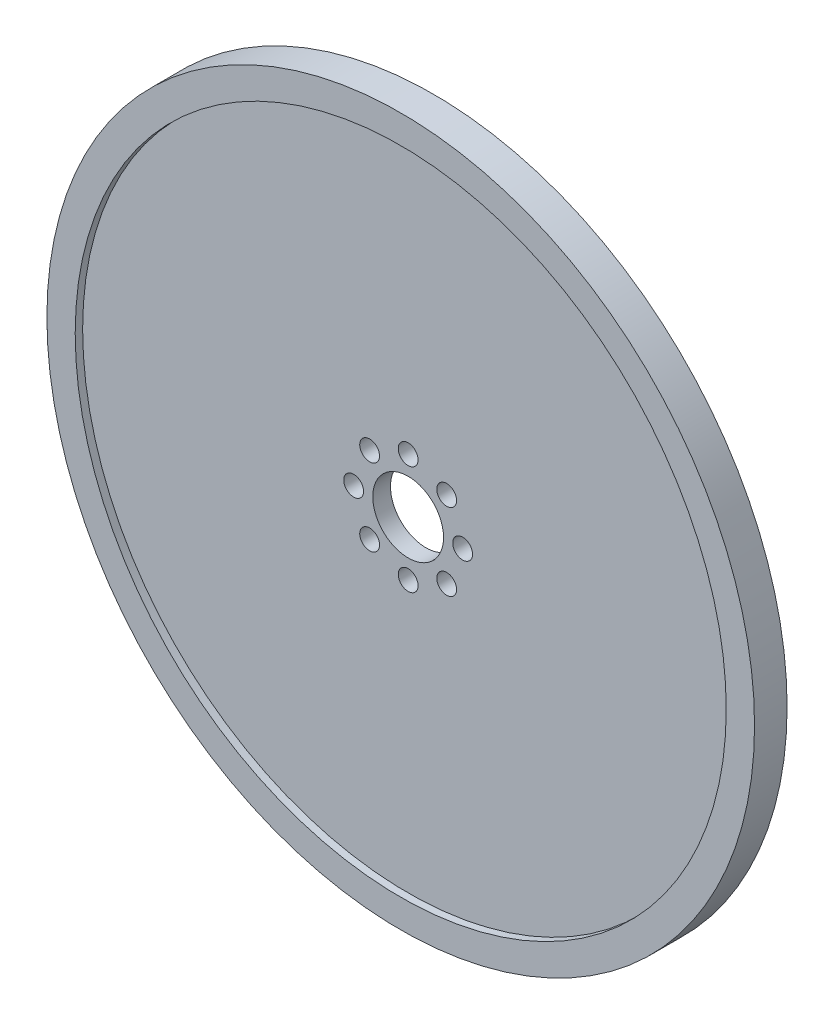
ISO-10303-21;
HEADER;
FILE_DESCRIPTION(('STEP AP214'),'2;1');
FILE_NAME('part.step','',(''),(''),'','','');
FILE_SCHEMA(('AUTOMOTIVE_DESIGN { 1 0 10303 214 1 1 1 1 }'));
ENDSEC;
DATA;
#1=APPLICATION_CONTEXT('core data for automotive mechanical design processes');
#2=APPLICATION_PROTOCOL_DEFINITION('international standard','automotive_design',2000,#1);
#3=PRODUCT_CONTEXT('',#1,'mechanical');
#4=PRODUCT('Part','Part','',(#3));
#5=PRODUCT_RELATED_PRODUCT_CATEGORY('part','',(#4));
#6=PRODUCT_DEFINITION_FORMATION('','',#4);
#7=PRODUCT_DEFINITION_CONTEXT('part definition',#1,'design');
#8=PRODUCT_DEFINITION('design','',#6,#7);
#9=PRODUCT_DEFINITION_SHAPE('','',#8);
#10=(LENGTH_UNIT() NAMED_UNIT(*) SI_UNIT(.MILLI.,.METRE.));
#11=(NAMED_UNIT(*) PLANE_ANGLE_UNIT() SI_UNIT($,.RADIAN.));
#12=(NAMED_UNIT(*) SI_UNIT($,.STERADIAN.) SOLID_ANGLE_UNIT());
#13=UNCERTAINTY_MEASURE_WITH_UNIT(LENGTH_MEASURE(1.E-05),#10,'distance_accuracy_value','');
#14=(GEOMETRIC_REPRESENTATION_CONTEXT(3) GLOBAL_UNCERTAINTY_ASSIGNED_CONTEXT((#13)) GLOBAL_UNIT_ASSIGNED_CONTEXT((#10,
#11,#12)) REPRESENTATION_CONTEXT('',''));
#15=CARTESIAN_POINT('',(0.,0.,0.));
#16=DIRECTION('',(0.,0.,1.));
#17=DIRECTION('',(1.,0.,0.));
#18=AXIS2_PLACEMENT_3D('',#15,#16,#17);
#19=CARTESIAN_POINT('',(0.,0.,2.921));
#20=DIRECTION('',(0.,0.,-1.));
#21=DIRECTION('',(-1.,0.,0.));
#22=AXIS2_PLACEMENT_3D('',#19,#20,#21);
#23=CYLINDRICAL_SURFACE('',#22,58.42);
#24=CARTESIAN_POINT('',(0.,0.,-2.921));
#25=DIRECTION('',(0.,0.,1.));
#26=DIRECTION('',(1.,0.,0.));
#27=AXIS2_PLACEMENT_3D('',#24,#25,#26);
#28=CIRCLE('',#27,58.42);
#29=CARTESIAN_POINT('',(58.42,0.,-2.921));
#30=VERTEX_POINT('',#29);
#31=EDGE_CURVE('E48',#30,#30,#28,.T.);
#32=ORIENTED_EDGE('',*,*,#31,.F.);
#33=EDGE_LOOP('',(#32));
#34=FACE_BOUND('',#33,.T.);
#35=CARTESIAN_POINT('',(0.,0.,-1.5875));
#36=DIRECTION('',(0.,0.,1.));
#37=DIRECTION('',(1.,0.,0.));
#38=AXIS2_PLACEMENT_3D('',#35,#36,#37);
#39=CIRCLE('',#38,58.42);
#40=CARTESIAN_POINT('',(58.42,0.,-1.5875));
#41=VERTEX_POINT('',#40);
#42=EDGE_CURVE('E51',#41,#41,#39,.T.);
#43=ORIENTED_EDGE('',*,*,#42,.T.);
#44=EDGE_LOOP('',(#43));
#45=FACE_BOUND('',#44,.T.);
#46=ADVANCED_FACE('F30',(#34,#45),#23,.F.);
#47=CARTESIAN_POINT('',(0.,0.,2.921));
#48=DIRECTION('',(0.,0.,1.));
#49=DIRECTION('',(1.,0.,0.));
#50=AXIS2_PLACEMENT_3D('',#47,#48,#49);
#51=PLANE('',#50);
#52=CARTESIAN_POINT('',(0.,0.,2.921));
#53=DIRECTION('',(0.,0.,1.));
#54=DIRECTION('',(1.,0.,0.));
#55=AXIS2_PLACEMENT_3D('',#52,#53,#54);
#56=CIRCLE('',#55,63.5);
#57=CARTESIAN_POINT('',(63.5,0.,2.921));
#58=VERTEX_POINT('',#57);
#59=EDGE_CURVE('E37',#58,#58,#56,.T.);
#60=ORIENTED_EDGE('',*,*,#59,.T.);
#61=EDGE_LOOP('',(#60));
#62=FACE_BOUND('',#61,.T.);
#63=CARTESIAN_POINT('',(0.,0.,2.921));
#64=DIRECTION('',(0.,0.,1.));
#65=DIRECTION('',(1.,0.,0.));
#66=AXIS2_PLACEMENT_3D('',#63,#64,#65);
#67=CIRCLE('',#66,58.42);
#68=CARTESIAN_POINT('',(58.42,0.,2.921));
#69=VERTEX_POINT('',#68);
#70=EDGE_CURVE('E46',#69,#69,#67,.T.);
#71=ORIENTED_EDGE('',*,*,#70,.F.);
#72=EDGE_LOOP('',(#71));
#73=FACE_BOUND('',#72,.T.);
#74=ADVANCED_FACE('F133',(#62,#73),#51,.T.);
#75=CARTESIAN_POINT('',(0.,0.,-2.921));
#76=DIRECTION('',(0.,0.,1.));
#77=DIRECTION('',(1.,0.,0.));
#78=AXIS2_PLACEMENT_3D('',#75,#76,#77);
#79=PLANE('',#78);
#80=CARTESIAN_POINT('',(0.,0.,-2.921));
#81=DIRECTION('',(0.,0.,1.));
#82=DIRECTION('',(1.,0.,0.));
#83=AXIS2_PLACEMENT_3D('',#80,#81,#82);
#84=CIRCLE('',#83,63.5);
#85=CARTESIAN_POINT('',(63.5,0.,-2.921));
#86=VERTEX_POINT('',#85);
#87=EDGE_CURVE('E41',#86,#86,#84,.T.);
#88=ORIENTED_EDGE('',*,*,#87,.F.);
#89=EDGE_LOOP('',(#88));
#90=FACE_BOUND('',#89,.T.);
#91=ORIENTED_EDGE('',*,*,#31,.T.);
#92=EDGE_LOOP('',(#91));
#93=FACE_BOUND('',#92,.T.);
#94=ADVANCED_FACE('F138',(#90,#93),#79,.F.);
#95=CARTESIAN_POINT('',(0.,0.,2.921));
#96=DIRECTION('',(0.,0.,-1.));
#97=DIRECTION('',(-1.,0.,0.));
#98=AXIS2_PLACEMENT_3D('',#95,#96,#97);
#99=CYLINDRICAL_SURFACE('',#98,63.5);
#100=ORIENTED_EDGE('',*,*,#59,.F.);
#101=EDGE_LOOP('',(#100));
#102=FACE_BOUND('',#101,.T.);
#103=ORIENTED_EDGE('',*,*,#87,.T.);
#104=EDGE_LOOP('',(#103));
#105=FACE_BOUND('',#104,.T.);
#106=ADVANCED_FACE('F32',(#102,#105),#99,.T.);
#107=CARTESIAN_POINT('',(0.,0.,1.5875));
#108=DIRECTION('',(0.,0.,1.));
#109=DIRECTION('',(1.,0.,0.));
#110=AXIS2_PLACEMENT_3D('',#107,#108,#109);
#111=CIRCLE('',#110,58.42);
#112=CARTESIAN_POINT('',(58.42,0.,1.5875));
#113=VERTEX_POINT('',#112);
#114=EDGE_CURVE('E10',#113,#113,#111,.T.);
#115=ORIENTED_EDGE('',*,*,#114,.F.);
#116=EDGE_LOOP('',(#115));
#117=FACE_BOUND('',#116,.T.);
#118=ORIENTED_EDGE('',*,*,#70,.T.);
#119=EDGE_LOOP('',(#118));
#120=FACE_BOUND('',#119,.T.);
#121=ADVANCED_FACE('F117',(#117,#120),#23,.F.);
#122=CARTESIAN_POINT('',(0.,0.,1.5875));
#123=DIRECTION('',(0.,0.,1.));
#124=DIRECTION('',(1.,0.,0.));
#125=AXIS2_PLACEMENT_3D('',#122,#123,#124);
#126=PLANE('',#125);
#127=CARTESIAN_POINT('',(-9.779,1.02429588037641E-13,1.5875));
#128=DIRECTION('',(0.,0.,1.));
#129=DIRECTION('',(1.,0.,0.));
#130=AXIS2_PLACEMENT_3D('',#127,#128,#129);
#131=CIRCLE('',#130,1.778);
#132=CARTESIAN_POINT('',(-8.001,1.02429588037641E-13,1.5875));
#133=VERTEX_POINT('',#132);
#134=EDGE_CURVE('E96',#133,#133,#131,.T.);
#135=ORIENTED_EDGE('',*,*,#134,.F.);
#136=EDGE_LOOP('',(#135));
#137=FACE_BOUND('',#136,.T.);
#138=CARTESIAN_POINT('',(0.,-9.779,1.5875));
#139=DIRECTION('',(0.,0.,1.));
#140=DIRECTION('',(1.,0.,0.));
#141=AXIS2_PLACEMENT_3D('',#138,#139,#140);
#142=CIRCLE('',#141,1.778);
#143=CARTESIAN_POINT('',(1.77799999999993,-9.779,1.5875));
#144=VERTEX_POINT('',#143);
#145=EDGE_CURVE('E84',#144,#144,#142,.T.);
#146=ORIENTED_EDGE('',*,*,#145,.F.);
#147=EDGE_LOOP('',(#146));
#148=FACE_BOUND('',#147,.T.);
#149=CARTESIAN_POINT('',(9.779,0.,1.5875));
#150=DIRECTION('',(0.,0.,1.));
#151=DIRECTION('',(1.,0.,0.));
#152=AXIS2_PLACEMENT_3D('',#149,#150,#151);
#153=CIRCLE('',#152,1.778);
#154=CARTESIAN_POINT('',(11.557,0.,1.5875));
#155=VERTEX_POINT('',#154);
#156=EDGE_CURVE('E72',#155,#155,#153,.T.);
#157=ORIENTED_EDGE('',*,*,#156,.F.);
#158=EDGE_LOOP('',(#157));
#159=FACE_BOUND('',#158,.T.);
#160=CARTESIAN_POINT('',(0.,9.779,1.5875));
#161=DIRECTION('',(0.,0.,1.));
#162=DIRECTION('',(1.,0.,0.));
#163=AXIS2_PLACEMENT_3D('',#160,#161,#162);
#164=CIRCLE('',#163,1.778);
#165=CARTESIAN_POINT('',(1.778,9.779,1.5875));
#166=VERTEX_POINT('',#165);
#167=EDGE_CURVE('E60',#166,#166,#164,.T.);
#168=ORIENTED_EDGE('',*,*,#167,.F.);
#169=EDGE_LOOP('',(#168));
#170=FACE_BOUND('',#169,.T.);
#171=ORIENTED_EDGE('',*,*,#114,.T.);
#172=EDGE_LOOP('',(#171));
#173=FACE_BOUND('',#172,.T.);
#174=CARTESIAN_POINT('',(0.,0.,1.5875));
#175=DIRECTION('',(0.,0.,1.));
#176=DIRECTION('',(1.,0.,0.));
#177=AXIS2_PLACEMENT_3D('',#174,#175,#176);
#178=CIRCLE('',#177,6.35);
#179=CARTESIAN_POINT('',(6.35,0.,1.5875));
#180=VERTEX_POINT('',#179);
#181=EDGE_CURVE('E56',#180,#180,#178,.T.);
#182=ORIENTED_EDGE('',*,*,#181,.F.);
#183=EDGE_LOOP('',(#182));
#184=FACE_BOUND('',#183,.T.);
#185=CARTESIAN_POINT('',(6.91479721322326,6.91479721322324,1.5875));
#186=DIRECTION('',(0.,0.,1.));
#187=DIRECTION('',(1.,0.,0.));
#188=AXIS2_PLACEMENT_3D('',#185,#186,#187);
#189=CIRCLE('',#188,1.778);
#190=CARTESIAN_POINT('',(8.69279721322326,6.91479721322324,1.5875));
#191=VERTEX_POINT('',#190);
#192=EDGE_CURVE('E66',#191,#191,#189,.T.);
#193=ORIENTED_EDGE('',*,*,#192,.F.);
#194=EDGE_LOOP('',(#193));
#195=FACE_BOUND('',#194,.T.);
#196=CARTESIAN_POINT('',(6.91479721322321,-6.91479721322328,1.5875));
#197=DIRECTION('',(0.,0.,1.));
#198=DIRECTION('',(1.,0.,0.));
#199=AXIS2_PLACEMENT_3D('',#196,#197,#198);
#200=CIRCLE('',#199,1.778);
#201=CARTESIAN_POINT('',(8.69279721322321,-6.91479721322328,1.5875));
#202=VERTEX_POINT('',#201);
#203=EDGE_CURVE('E78',#202,#202,#200,.T.);
#204=ORIENTED_EDGE('',*,*,#203,.F.);
#205=EDGE_LOOP('',(#204));
#206=FACE_BOUND('',#205,.T.);
#207=CARTESIAN_POINT('',(-6.91479721322331,-6.91479721322319,1.5875));
#208=DIRECTION('',(0.,0.,1.));
#209=DIRECTION('',(1.,0.,0.));
#210=AXIS2_PLACEMENT_3D('',#207,#208,#209);
#211=CIRCLE('',#210,1.778);
#212=CARTESIAN_POINT('',(-5.13679721322331,-6.91479721322319,1.5875));
#213=VERTEX_POINT('',#212);
#214=EDGE_CURVE('E90',#213,#213,#211,.T.);
#215=ORIENTED_EDGE('',*,*,#214,.F.);
#216=EDGE_LOOP('',(#215));
#217=FACE_BOUND('',#216,.T.);
#218=CARTESIAN_POINT('',(-6.91479721322316,6.91479721322333,1.5875));
#219=DIRECTION('',(0.,0.,1.));
#220=DIRECTION('',(1.,0.,0.));
#221=AXIS2_PLACEMENT_3D('',#218,#219,#220);
#222=CIRCLE('',#221,1.778);
#223=CARTESIAN_POINT('',(-5.13679721322316,6.91479721322333,1.5875));
#224=VERTEX_POINT('',#223);
#225=EDGE_CURVE('E102',#224,#224,#222,.T.);
#226=ORIENTED_EDGE('',*,*,#225,.F.);
#227=EDGE_LOOP('',(#226));
#228=FACE_BOUND('',#227,.T.);
#229=ADVANCED_FACE('F114',(#137,#148,#159,#170,#173,#184,#195,#206,#217,#228),#126,.T.);
#230=CARTESIAN_POINT('',(0.,0.,-1.5875));
#231=DIRECTION('',(0.,0.,1.));
#232=DIRECTION('',(1.,0.,0.));
#233=AXIS2_PLACEMENT_3D('',#230,#231,#232);
#234=PLANE('',#233);
#235=CARTESIAN_POINT('',(-9.779,1.02429588037641E-13,-1.5875));
#236=DIRECTION('',(0.,0.,1.));
#237=DIRECTION('',(1.,0.,0.));
#238=AXIS2_PLACEMENT_3D('',#235,#236,#237);
#239=CIRCLE('',#238,1.778);
#240=CARTESIAN_POINT('',(-8.001,1.02429588037641E-13,-1.5875));
#241=VERTEX_POINT('',#240);
#242=EDGE_CURVE('E99',#241,#241,#239,.T.);
#243=ORIENTED_EDGE('',*,*,#242,.T.);
#244=EDGE_LOOP('',(#243));
#245=FACE_BOUND('',#244,.T.);
#246=CARTESIAN_POINT('',(0.,-9.779,-1.5875));
#247=DIRECTION('',(0.,0.,1.));
#248=DIRECTION('',(1.,0.,0.));
#249=AXIS2_PLACEMENT_3D('',#246,#247,#248);
#250=CIRCLE('',#249,1.778);
#251=CARTESIAN_POINT('',(1.77799999999993,-9.779,-1.5875));
#252=VERTEX_POINT('',#251);
#253=EDGE_CURVE('E87',#252,#252,#250,.T.);
#254=ORIENTED_EDGE('',*,*,#253,.T.);
#255=EDGE_LOOP('',(#254));
#256=FACE_BOUND('',#255,.T.);
#257=CARTESIAN_POINT('',(9.779,0.,-1.5875));
#258=DIRECTION('',(0.,0.,1.));
#259=DIRECTION('',(1.,0.,0.));
#260=AXIS2_PLACEMENT_3D('',#257,#258,#259);
#261=CIRCLE('',#260,1.778);
#262=CARTESIAN_POINT('',(11.557,0.,-1.5875));
#263=VERTEX_POINT('',#262);
#264=EDGE_CURVE('E75',#263,#263,#261,.T.);
#265=ORIENTED_EDGE('',*,*,#264,.T.);
#266=EDGE_LOOP('',(#265));
#267=FACE_BOUND('',#266,.T.);
#268=CARTESIAN_POINT('',(0.,9.779,-1.5875));
#269=DIRECTION('',(0.,0.,1.));
#270=DIRECTION('',(1.,0.,0.));
#271=AXIS2_PLACEMENT_3D('',#268,#269,#270);
#272=CIRCLE('',#271,1.778);
#273=CARTESIAN_POINT('',(1.778,9.779,-1.5875));
#274=VERTEX_POINT('',#273);
#275=EDGE_CURVE('E63',#274,#274,#272,.T.);
#276=ORIENTED_EDGE('',*,*,#275,.T.);
#277=EDGE_LOOP('',(#276));
#278=FACE_BOUND('',#277,.T.);
#279=ORIENTED_EDGE('',*,*,#42,.F.);
#280=EDGE_LOOP('',(#279));
#281=FACE_BOUND('',#280,.T.);
#282=CARTESIAN_POINT('',(0.,0.,-1.5875));
#283=DIRECTION('',(0.,0.,1.));
#284=DIRECTION('',(1.,0.,0.));
#285=AXIS2_PLACEMENT_3D('',#282,#283,#284);
#286=CIRCLE('',#285,6.35);
#287=CARTESIAN_POINT('',(6.35,0.,-1.5875));
#288=VERTEX_POINT('',#287);
#289=EDGE_CURVE('E57',#288,#288,#286,.T.);
#290=ORIENTED_EDGE('',*,*,#289,.T.);
#291=EDGE_LOOP('',(#290));
#292=FACE_BOUND('',#291,.T.);
#293=CARTESIAN_POINT('',(6.91479721322326,6.91479721322324,-1.5875));
#294=DIRECTION('',(0.,0.,1.));
#295=DIRECTION('',(1.,0.,0.));
#296=AXIS2_PLACEMENT_3D('',#293,#294,#295);
#297=CIRCLE('',#296,1.778);
#298=CARTESIAN_POINT('',(8.69279721322326,6.91479721322324,-1.5875));
#299=VERTEX_POINT('',#298);
#300=EDGE_CURVE('E69',#299,#299,#297,.T.);
#301=ORIENTED_EDGE('',*,*,#300,.T.);
#302=EDGE_LOOP('',(#301));
#303=FACE_BOUND('',#302,.T.);
#304=CARTESIAN_POINT('',(6.91479721322321,-6.91479721322328,-1.5875));
#305=DIRECTION('',(0.,0.,1.));
#306=DIRECTION('',(1.,0.,0.));
#307=AXIS2_PLACEMENT_3D('',#304,#305,#306);
#308=CIRCLE('',#307,1.778);
#309=CARTESIAN_POINT('',(8.69279721322321,-6.91479721322328,-1.5875));
#310=VERTEX_POINT('',#309);
#311=EDGE_CURVE('E81',#310,#310,#308,.T.);
#312=ORIENTED_EDGE('',*,*,#311,.T.);
#313=EDGE_LOOP('',(#312));
#314=FACE_BOUND('',#313,.T.);
#315=CARTESIAN_POINT('',(-6.91479721322331,-6.91479721322319,-1.5875));
#316=DIRECTION('',(0.,0.,1.));
#317=DIRECTION('',(1.,0.,0.));
#318=AXIS2_PLACEMENT_3D('',#315,#316,#317);
#319=CIRCLE('',#318,1.778);
#320=CARTESIAN_POINT('',(-5.13679721322331,-6.91479721322319,-1.5875));
#321=VERTEX_POINT('',#320);
#322=EDGE_CURVE('E93',#321,#321,#319,.T.);
#323=ORIENTED_EDGE('',*,*,#322,.T.);
#324=EDGE_LOOP('',(#323));
#325=FACE_BOUND('',#324,.T.);
#326=CARTESIAN_POINT('',(-6.91479721322316,6.91479721322333,-1.5875));
#327=DIRECTION('',(0.,0.,1.));
#328=DIRECTION('',(1.,0.,0.));
#329=AXIS2_PLACEMENT_3D('',#326,#327,#328);
#330=CIRCLE('',#329,1.778);
#331=CARTESIAN_POINT('',(-5.13679721322316,6.91479721322333,-1.5875));
#332=VERTEX_POINT('',#331);
#333=EDGE_CURVE('E105',#332,#332,#330,.T.);
#334=ORIENTED_EDGE('',*,*,#333,.T.);
#335=EDGE_LOOP('',(#334));
#336=FACE_BOUND('',#335,.T.);
#337=ADVANCED_FACE('F116',(#245,#256,#267,#278,#281,#292,#303,#314,#325,#336),#234,.F.);
#338=CARTESIAN_POINT('',(0.,0.,1.5875));
#339=DIRECTION('',(0.,0.,-1.));
#340=DIRECTION('',(-1.,0.,0.));
#341=AXIS2_PLACEMENT_3D('',#338,#339,#340);
#342=CYLINDRICAL_SURFACE('',#341,6.35);
#343=ORIENTED_EDGE('',*,*,#181,.T.);
#344=EDGE_LOOP('',(#343));
#345=FACE_BOUND('',#344,.T.);
#346=ORIENTED_EDGE('',*,*,#289,.F.);
#347=EDGE_LOOP('',(#346));
#348=FACE_BOUND('',#347,.T.);
#349=ADVANCED_FACE('F124',(#345,#348),#342,.F.);
#350=CARTESIAN_POINT('',(0.,9.779,1.5875));
#351=DIRECTION('',(0.,0.,-1.));
#352=DIRECTION('',(-1.,0.,0.));
#353=AXIS2_PLACEMENT_3D('',#350,#351,#352);
#354=CYLINDRICAL_SURFACE('',#353,1.778);
#355=ORIENTED_EDGE('',*,*,#167,.T.);
#356=EDGE_LOOP('',(#355));
#357=FACE_BOUND('',#356,.T.);
#358=ORIENTED_EDGE('',*,*,#275,.F.);
#359=EDGE_LOOP('',(#358));
#360=FACE_BOUND('',#359,.T.);
#361=ADVANCED_FACE('F178',(#357,#360),#354,.F.);
#362=CARTESIAN_POINT('',(6.91479721322326,6.91479721322324,1.5875));
#363=DIRECTION('',(0.,0.,-1.));
#364=DIRECTION('',(-1.,0.,0.));
#365=AXIS2_PLACEMENT_3D('',#362,#363,#364);
#366=CYLINDRICAL_SURFACE('',#365,1.778);
#367=ORIENTED_EDGE('',*,*,#192,.T.);
#368=EDGE_LOOP('',(#367));
#369=FACE_BOUND('',#368,.T.);
#370=ORIENTED_EDGE('',*,*,#300,.F.);
#371=EDGE_LOOP('',(#370));
#372=FACE_BOUND('',#371,.T.);
#373=ADVANCED_FACE('F187',(#369,#372),#366,.F.);
#374=CARTESIAN_POINT('',(9.779,0.,1.5875));
#375=DIRECTION('',(0.,0.,-1.));
#376=DIRECTION('',(-1.,0.,0.));
#377=AXIS2_PLACEMENT_3D('',#374,#375,#376);
#378=CYLINDRICAL_SURFACE('',#377,1.778);
#379=ORIENTED_EDGE('',*,*,#156,.T.);
#380=EDGE_LOOP('',(#379));
#381=FACE_BOUND('',#380,.T.);
#382=ORIENTED_EDGE('',*,*,#264,.F.);
#383=EDGE_LOOP('',(#382));
#384=FACE_BOUND('',#383,.T.);
#385=ADVANCED_FACE('F197',(#381,#384),#378,.F.);
#386=CARTESIAN_POINT('',(6.91479721322321,-6.91479721322328,1.5875));
#387=DIRECTION('',(0.,0.,-1.));
#388=DIRECTION('',(-1.,0.,0.));
#389=AXIS2_PLACEMENT_3D('',#386,#387,#388);
#390=CYLINDRICAL_SURFACE('',#389,1.778);
#391=ORIENTED_EDGE('',*,*,#203,.T.);
#392=EDGE_LOOP('',(#391));
#393=FACE_BOUND('',#392,.T.);
#394=ORIENTED_EDGE('',*,*,#311,.F.);
#395=EDGE_LOOP('',(#394));
#396=FACE_BOUND('',#395,.T.);
#397=ADVANCED_FACE('F207',(#393,#396),#390,.F.);
#398=CARTESIAN_POINT('',(0.,-9.779,1.5875));
#399=DIRECTION('',(0.,0.,-1.));
#400=DIRECTION('',(-1.,0.,0.));
#401=AXIS2_PLACEMENT_3D('',#398,#399,#400);
#402=CYLINDRICAL_SURFACE('',#401,1.778);
#403=ORIENTED_EDGE('',*,*,#145,.T.);
#404=EDGE_LOOP('',(#403));
#405=FACE_BOUND('',#404,.T.);
#406=ORIENTED_EDGE('',*,*,#253,.F.);
#407=EDGE_LOOP('',(#406));
#408=FACE_BOUND('',#407,.T.);
#409=ADVANCED_FACE('F217',(#405,#408),#402,.F.);
#410=CARTESIAN_POINT('',(-6.91479721322331,-6.91479721322319,1.5875));
#411=DIRECTION('',(0.,0.,-1.));
#412=DIRECTION('',(-1.,0.,0.));
#413=AXIS2_PLACEMENT_3D('',#410,#411,#412);
#414=CYLINDRICAL_SURFACE('',#413,1.778);
#415=ORIENTED_EDGE('',*,*,#214,.T.);
#416=EDGE_LOOP('',(#415));
#417=FACE_BOUND('',#416,.T.);
#418=ORIENTED_EDGE('',*,*,#322,.F.);
#419=EDGE_LOOP('',(#418));
#420=FACE_BOUND('',#419,.T.);
#421=ADVANCED_FACE('F227',(#417,#420),#414,.F.);
#422=CARTESIAN_POINT('',(-9.779,1.02429588037641E-13,1.5875));
#423=DIRECTION('',(0.,0.,-1.));
#424=DIRECTION('',(-1.,0.,0.));
#425=AXIS2_PLACEMENT_3D('',#422,#423,#424);
#426=CYLINDRICAL_SURFACE('',#425,1.778);
#427=ORIENTED_EDGE('',*,*,#134,.T.);
#428=EDGE_LOOP('',(#427));
#429=FACE_BOUND('',#428,.T.);
#430=ORIENTED_EDGE('',*,*,#242,.F.);
#431=EDGE_LOOP('',(#430));
#432=FACE_BOUND('',#431,.T.);
#433=ADVANCED_FACE('F237',(#429,#432),#426,.F.);
#434=CARTESIAN_POINT('',(-6.91479721322316,6.91479721322333,1.5875));
#435=DIRECTION('',(0.,0.,-1.));
#436=DIRECTION('',(-1.,0.,0.));
#437=AXIS2_PLACEMENT_3D('',#434,#435,#436);
#438=CYLINDRICAL_SURFACE('',#437,1.778);
#439=ORIENTED_EDGE('',*,*,#225,.T.);
#440=EDGE_LOOP('',(#439));
#441=FACE_BOUND('',#440,.T.);
#442=ORIENTED_EDGE('',*,*,#333,.F.);
#443=EDGE_LOOP('',(#442));
#444=FACE_BOUND('',#443,.T.);
#445=ADVANCED_FACE('F111',(#441,#444),#438,.F.);
#446=CLOSED_SHELL('',(#46,#74,#94,#106,#121,#229,#337,#349,#361,#373,#385,#397,#409,#421,#433,#445));
#447=MANIFOLD_SOLID_BREP('B2',#446);
#448=ADVANCED_BREP_SHAPE_REPRESENTATION('',(#18,#447),#14);
#449=SHAPE_DEFINITION_REPRESENTATION(#9,#448);
ENDSEC;
END-ISO-10303-21;
